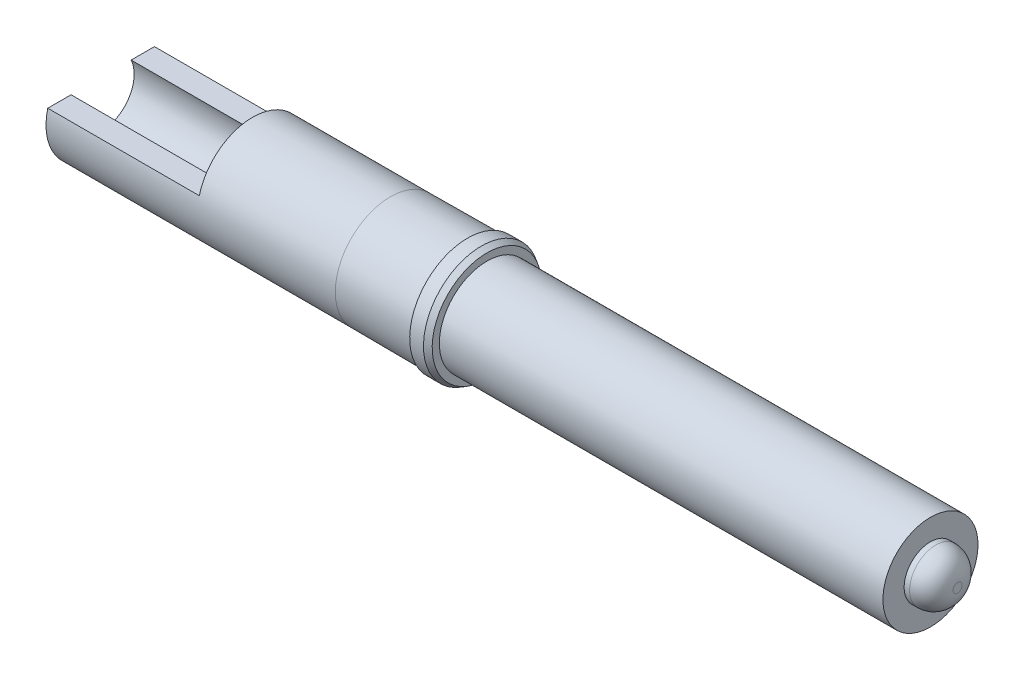
ISO-10303-21;
HEADER;
FILE_DESCRIPTION(('STEP AP214'),'2;1');
FILE_NAME('part.step','',(''),(''),'','','');
FILE_SCHEMA(('AUTOMOTIVE_DESIGN { 1 0 10303 214 1 1 1 1 }'));
ENDSEC;
DATA;
#1=APPLICATION_CONTEXT('core data for automotive mechanical design processes');
#2=APPLICATION_PROTOCOL_DEFINITION('international standard','automotive_design',2000,#1);
#3=PRODUCT_CONTEXT('',#1,'mechanical');
#4=PRODUCT('Part','Part','',(#3));
#5=PRODUCT_RELATED_PRODUCT_CATEGORY('part','',(#4));
#6=PRODUCT_DEFINITION_FORMATION('','',#4);
#7=PRODUCT_DEFINITION_CONTEXT('part definition',#1,'design');
#8=PRODUCT_DEFINITION('design','',#6,#7);
#9=PRODUCT_DEFINITION_SHAPE('','',#8);
#10=(LENGTH_UNIT() NAMED_UNIT(*) SI_UNIT(.MILLI.,.METRE.));
#11=(NAMED_UNIT(*) PLANE_ANGLE_UNIT() SI_UNIT($,.RADIAN.));
#12=(NAMED_UNIT(*) SI_UNIT($,.STERADIAN.) SOLID_ANGLE_UNIT());
#13=UNCERTAINTY_MEASURE_WITH_UNIT(LENGTH_MEASURE(1.E-05),#10,'distance_accuracy_value','');
#14=(GEOMETRIC_REPRESENTATION_CONTEXT(3) GLOBAL_UNCERTAINTY_ASSIGNED_CONTEXT((#13)) GLOBAL_UNIT_ASSIGNED_CONTEXT((#10,
#11,#12)) REPRESENTATION_CONTEXT('',''));
#15=CARTESIAN_POINT('',(0.,0.,0.));
#16=DIRECTION('',(0.,0.,1.));
#17=DIRECTION('',(1.,0.,0.));
#18=AXIS2_PLACEMENT_3D('',#15,#16,#17);
#19=CARTESIAN_POINT('',(1.397,0.127,-0.491868884968342));
#20=DIRECTION('',(0.,-1.,0.));
#21=DIRECTION('',(1.,0.,0.));
#22=AXIS2_PLACEMENT_3D('',#19,#20,#21);
#23=PLANE('',#22);
#24=DIRECTION('',(0.,0.,1.));
#25=VECTOR('',#24,1.);
#26=CARTESIAN_POINT('',(1.397,0.127,-0.491868884968342));
#27=LINE('',#26,#25);
#28=CARTESIAN_POINT('',(1.397,0.127,0.277081287711746));
#29=VERTEX_POINT('',#28);
#30=CARTESIAN_POINT('',(1.397,0.127,0.491868884968342));
#31=VERTEX_POINT('',#30);
#32=EDGE_CURVE('E111',#29,#31,#27,.T.);
#33=ORIENTED_EDGE('',*,*,#32,.F.);
#34=DIRECTION('',(-1.,0.,0.));
#35=VECTOR('',#34,1.);
#36=CARTESIAN_POINT('',(0.,0.127,0.277081287711746));
#37=LINE('',#36,#35);
#38=CARTESIAN_POINT('',(0.,0.127,0.277081287711746));
#39=VERTEX_POINT('',#38);
#40=EDGE_CURVE('E52',#29,#39,#37,.T.);
#41=ORIENTED_EDGE('',*,*,#40,.T.);
#42=DIRECTION('',(0.,0.,1.));
#43=VECTOR('',#42,1.);
#44=CARTESIAN_POINT('',(0.,0.127,-0.491868884968342));
#45=LINE('',#44,#43);
#46=CARTESIAN_POINT('',(0.,0.127,0.491868884968342));
#47=VERTEX_POINT('',#46);
#48=EDGE_CURVE('E103',#39,#47,#45,.T.);
#49=ORIENTED_EDGE('',*,*,#48,.T.);
#50=DIRECTION('',(-1.,0.,0.));
#51=VECTOR('',#50,1.);
#52=CARTESIAN_POINT('',(1.397,0.127,0.491868884968342));
#53=LINE('',#52,#51);
#54=EDGE_CURVE('E117',#31,#47,#53,.T.);
#55=ORIENTED_EDGE('',*,*,#54,.F.);
#56=EDGE_LOOP('',(#33,#41,#49,#55));
#57=FACE_BOUND('',#56,.T.);
#58=ADVANCED_FACE('F37',(#57),#23,.F.);
#59=CARTESIAN_POINT('',(3.5052,0.,0.));
#60=DIRECTION('',(-1.,0.,0.));
#61=DIRECTION('',(0.,-1.,0.));
#62=AXIS2_PLACEMENT_3D('',#59,#60,#61);
#63=CONICAL_SURFACE('',#62,0.5334,0.523598775598299);
#64=CARTESIAN_POINT('',(3.556,0.,0.));
#65=DIRECTION('',(-1.,0.,0.));
#66=DIRECTION('',(0.,-1.,0.));
#67=AXIS2_PLACEMENT_3D('',#64,#65,#66);
#68=CIRCLE('',#67,0.504070606325167);
#69=CARTESIAN_POINT('',(3.556,-0.504070606325167,0.));
#70=VERTEX_POINT('',#69);
#71=EDGE_CURVE('E194',#70,#70,#68,.T.);
#72=ORIENTED_EDGE('',*,*,#71,.T.);
#73=EDGE_LOOP('',(#72));
#74=FACE_BOUND('',#73,.T.);
#75=CARTESIAN_POINT('',(3.5052,0.,0.));
#76=DIRECTION('',(-1.,0.,0.));
#77=DIRECTION('',(0.,-1.,0.));
#78=AXIS2_PLACEMENT_3D('',#75,#76,#77);
#79=CIRCLE('',#78,0.5334);
#80=CARTESIAN_POINT('',(3.5052,-0.5334,0.));
#81=VERTEX_POINT('',#80);
#82=EDGE_CURVE('E199',#81,#81,#79,.T.);
#83=ORIENTED_EDGE('',*,*,#82,.F.);
#84=EDGE_LOOP('',(#83));
#85=FACE_BOUND('',#84,.T.);
#86=ADVANCED_FACE('F190',(#74,#85),#63,.T.);
#87=CARTESIAN_POINT('',(3.556,0.504070606325167,0.));
#88=DIRECTION('',(1.,0.,0.));
#89=DIRECTION('',(0.,1.,0.));
#90=AXIS2_PLACEMENT_3D('',#87,#88,#89);
#91=PLANE('',#90);
#92=CARTESIAN_POINT('',(3.556,0.,0.));
#93=DIRECTION('',(1.,0.,0.));
#94=DIRECTION('',(0.,0.,-1.));
#95=AXIS2_PLACEMENT_3D('',#92,#93,#94);
#96=CIRCLE('',#95,0.43815);
#97=CARTESIAN_POINT('',(3.556,0.,-0.43815));
#98=VERTEX_POINT('',#97);
#99=EDGE_CURVE('E104',#98,#98,#96,.T.);
#100=ORIENTED_EDGE('',*,*,#99,.F.);
#101=EDGE_LOOP('',(#100));
#102=FACE_BOUND('',#101,.T.);
#103=ORIENTED_EDGE('',*,*,#71,.F.);
#104=EDGE_LOOP('',(#103));
#105=FACE_BOUND('',#104,.T.);
#106=ADVANCED_FACE('F186',(#102,#105),#91,.T.);
#107=CARTESIAN_POINT('',(3.3782,0.,0.));
#108=DIRECTION('',(-1.,0.,0.));
#109=DIRECTION('',(0.,-1.,0.));
#110=AXIS2_PLACEMENT_3D('',#107,#108,#109);
#111=PLANE('',#110);
#112=CARTESIAN_POINT('',(3.3782,0.,0.));
#113=DIRECTION('',(-1.,0.,0.));
#114=DIRECTION('',(0.,0.,1.));
#115=AXIS2_PLACEMENT_3D('',#112,#113,#114);
#116=CIRCLE('',#115,0.51181);
#117=CARTESIAN_POINT('',(3.3782,0.,0.51181));
#118=VERTEX_POINT('',#117);
#119=EDGE_CURVE('E108',#118,#118,#116,.T.);
#120=ORIENTED_EDGE('',*,*,#119,.F.);
#121=EDGE_LOOP('',(#120));
#122=FACE_BOUND('',#121,.T.);
#123=CARTESIAN_POINT('',(3.3782,0.,0.));
#124=DIRECTION('',(-1.,0.,0.));
#125=DIRECTION('',(0.,-1.,0.));
#126=AXIS2_PLACEMENT_3D('',#123,#124,#125);
#127=CIRCLE('',#126,0.5334);
#128=CARTESIAN_POINT('',(3.3782,-0.5334,0.));
#129=VERTEX_POINT('',#128);
#130=EDGE_CURVE('E196',#129,#129,#127,.T.);
#131=ORIENTED_EDGE('',*,*,#130,.T.);
#132=EDGE_LOOP('',(#131));
#133=FACE_BOUND('',#132,.T.);
#134=ADVANCED_FACE('F189',(#122,#133),#111,.T.);
#135=CARTESIAN_POINT('',(3.556,0.,0.));
#136=DIRECTION('',(-1.,0.,0.));
#137=DIRECTION('',(0.,-1.,0.));
#138=AXIS2_PLACEMENT_3D('',#135,#136,#137);
#139=CYLINDRICAL_SURFACE('',#138,0.5334);
#140=ORIENTED_EDGE('',*,*,#82,.T.);
#141=EDGE_LOOP('',(#140));
#142=FACE_BOUND('',#141,.T.);
#143=ORIENTED_EDGE('',*,*,#130,.F.);
#144=EDGE_LOOP('',(#143));
#145=FACE_BOUND('',#144,.T.);
#146=ADVANCED_FACE('F151',(#142,#145),#139,.T.);
#147=CARTESIAN_POINT('',(2.667,0.,0.));
#148=DIRECTION('',(1.,0.,0.));
#149=DIRECTION('',(0.,0.,-1.));
#150=AXIS2_PLACEMENT_3D('',#147,#148,#149);
#151=CYLINDRICAL_SURFACE('',#150,0.51181);
#152=CARTESIAN_POINT('',(2.667,0.,0.));
#153=DIRECTION('',(-1.,0.,0.));
#154=DIRECTION('',(0.,0.,1.));
#155=AXIS2_PLACEMENT_3D('',#152,#153,#154);
#156=CIRCLE('',#155,0.508);
#157=CARTESIAN_POINT('',(2.667,0.,0.508));
#158=VERTEX_POINT('',#157);
#159=EDGE_CURVE('E124',#158,#158,#156,.T.);
#160=ORIENTED_EDGE('',*,*,#159,.F.);
#161=EDGE_LOOP('',(#160));
#162=FACE_BOUND('',#161,.T.);
#163=ORIENTED_EDGE('',*,*,#119,.T.);
#164=EDGE_LOOP('',(#163));
#165=FACE_BOUND('',#164,.T.);
#166=ADVANCED_FACE('F145',(#162,#165),#151,.T.);
#167=CARTESIAN_POINT('',(0.,0.,0.));
#168=DIRECTION('',(1.,0.,0.));
#169=DIRECTION('',(0.,0.,-1.));
#170=AXIS2_PLACEMENT_3D('',#167,#168,#169);
#171=CYLINDRICAL_SURFACE('',#170,0.508);
#172=CARTESIAN_POINT('',(0.,0.,0.));
#173=DIRECTION('',(-1.,0.,0.));
#174=DIRECTION('',(0.,0.,1.));
#175=AXIS2_PLACEMENT_3D('',#172,#173,#174);
#176=CIRCLE('',#175,0.508);
#177=CARTESIAN_POINT('',(0.,0.127,-0.491868884968342));
#178=VERTEX_POINT('',#177);
#179=EDGE_CURVE('E120',#178,#47,#176,.T.);
#180=ORIENTED_EDGE('',*,*,#179,.F.);
#181=DIRECTION('',(-1.,0.,0.));
#182=VECTOR('',#181,1.);
#183=CARTESIAN_POINT('',(1.397,0.127,-0.491868884968342));
#184=LINE('',#183,#182);
#185=CARTESIAN_POINT('',(1.397,0.127,-0.491868884968342));
#186=VERTEX_POINT('',#185);
#187=EDGE_CURVE('E60',#186,#178,#184,.T.);
#188=ORIENTED_EDGE('',*,*,#187,.F.);
#189=CARTESIAN_POINT('',(1.397,0.,0.));
#190=DIRECTION('',(-1.,0.,0.));
#191=DIRECTION('',(0.,0.,1.));
#192=AXIS2_PLACEMENT_3D('',#189,#190,#191);
#193=CIRCLE('',#192,0.508);
#194=EDGE_CURVE('E109',#31,#186,#193,.T.);
#195=ORIENTED_EDGE('',*,*,#194,.F.);
#196=ORIENTED_EDGE('',*,*,#54,.T.);
#197=EDGE_LOOP('',(#180,#188,#195,#196));
#198=FACE_BOUND('',#197,.T.);
#199=ORIENTED_EDGE('',*,*,#159,.T.);
#200=EDGE_LOOP('',(#199));
#201=FACE_BOUND('',#200,.T.);
#202=ADVANCED_FACE('F134',(#198,#201),#171,.T.);
#203=CARTESIAN_POINT('',(0.,0.,0.));
#204=DIRECTION('',(-1.,0.,0.));
#205=DIRECTION('',(0.,0.,1.));
#206=AXIS2_PLACEMENT_3D('',#203,#204,#205);
#207=PLANE('',#206);
#208=CARTESIAN_POINT('',(0.,0.,0.));
#209=DIRECTION('',(-1.,0.,0.));
#210=DIRECTION('',(0.,0.,1.));
#211=AXIS2_PLACEMENT_3D('',#208,#209,#210);
#212=CIRCLE('',#211,0.304799999999999);
#213=CARTESIAN_POINT('',(0.,0.127,-0.277081287711746));
#214=VERTEX_POINT('',#213);
#215=EDGE_CURVE('E92',#214,#39,#212,.T.);
#216=ORIENTED_EDGE('',*,*,#215,.F.);
#217=EDGE_CURVE('E112',#178,#214,#45,.T.);
#218=ORIENTED_EDGE('',*,*,#217,.F.);
#219=ORIENTED_EDGE('',*,*,#179,.T.);
#220=ORIENTED_EDGE('',*,*,#48,.F.);
#221=EDGE_LOOP('',(#216,#218,#219,#220));
#222=FACE_BOUND('',#221,.T.);
#223=ADVANCED_FACE('F144',(#222),#207,.T.);
#224=ORIENTED_EDGE('',*,*,#217,.T.);
#225=DIRECTION('',(-1.,0.,0.));
#226=VECTOR('',#225,1.);
#227=CARTESIAN_POINT('',(0.,0.127,-0.277081287711746));
#228=LINE('',#227,#226);
#229=CARTESIAN_POINT('',(1.397,0.127,-0.277081287711746));
#230=VERTEX_POINT('',#229);
#231=EDGE_CURVE('E91',#214,#230,#228,.F.);
#232=ORIENTED_EDGE('',*,*,#231,.T.);
#233=EDGE_CURVE('E113',#186,#230,#27,.T.);
#234=ORIENTED_EDGE('',*,*,#233,.F.);
#235=ORIENTED_EDGE('',*,*,#187,.T.);
#236=EDGE_LOOP('',(#224,#232,#234,#235));
#237=FACE_BOUND('',#236,.T.);
#238=ADVANCED_FACE('F211',(#237),#23,.F.);
#239=CARTESIAN_POINT('',(1.397,0.,0.));
#240=DIRECTION('',(-1.,0.,0.));
#241=DIRECTION('',(0.,0.,1.));
#242=AXIS2_PLACEMENT_3D('',#239,#240,#241);
#243=PLANE('',#242);
#244=CARTESIAN_POINT('',(1.397,0.,0.));
#245=DIRECTION('',(-1.,0.,0.));
#246=DIRECTION('',(0.,0.,1.));
#247=AXIS2_PLACEMENT_3D('',#244,#245,#246);
#248=CIRCLE('',#247,0.304799999999999);
#249=EDGE_CURVE('E107',#29,#230,#248,.T.);
#250=ORIENTED_EDGE('',*,*,#249,.F.);
#251=ORIENTED_EDGE('',*,*,#32,.T.);
#252=ORIENTED_EDGE('',*,*,#194,.T.);
#253=ORIENTED_EDGE('',*,*,#233,.T.);
#254=EDGE_LOOP('',(#250,#251,#252,#253));
#255=FACE_BOUND('',#254,.T.);
#256=ADVANCED_FACE('F182',(#255),#243,.T.);
#257=CARTESIAN_POINT('',(7.6454,0.,0.));
#258=DIRECTION('',(-1.,0.,0.));
#259=DIRECTION('',(0.,0.,1.));
#260=AXIS2_PLACEMENT_3D('',#257,#258,#259);
#261=CYLINDRICAL_SURFACE('',#260,0.43815);
#262=CARTESIAN_POINT('',(7.6454,0.,0.));
#263=DIRECTION('',(1.,0.,0.));
#264=DIRECTION('',(0.,0.,-1.));
#265=AXIS2_PLACEMENT_3D('',#262,#263,#264);
#266=CIRCLE('',#265,0.43815);
#267=CARTESIAN_POINT('',(7.6454,0.,-0.43815));
#268=VERTEX_POINT('',#267);
#269=EDGE_CURVE('E100',#268,#268,#266,.T.);
#270=ORIENTED_EDGE('',*,*,#269,.F.);
#271=EDGE_LOOP('',(#270));
#272=FACE_BOUND('',#271,.T.);
#273=ORIENTED_EDGE('',*,*,#99,.T.);
#274=EDGE_LOOP('',(#273));
#275=FACE_BOUND('',#274,.T.);
#276=ADVANCED_FACE('F176',(#272,#275),#261,.T.);
#277=CARTESIAN_POINT('',(7.6454,0.,0.));
#278=DIRECTION('',(1.,0.,0.));
#279=DIRECTION('',(0.,0.,-1.));
#280=AXIS2_PLACEMENT_3D('',#277,#278,#279);
#281=PLANE('',#280);
#282=CARTESIAN_POINT('',(7.6454,0.,0.));
#283=DIRECTION('',(1.,0.,0.));
#284=DIRECTION('',(0.,0.,-1.));
#285=AXIS2_PLACEMENT_3D('',#282,#283,#284);
#286=CIRCLE('',#285,0.24257);
#287=CARTESIAN_POINT('',(7.6454,0.,-0.24257));
#288=VERTEX_POINT('',#287);
#289=EDGE_CURVE('E165',#288,#288,#286,.T.);
#290=ORIENTED_EDGE('',*,*,#289,.F.);
#291=EDGE_LOOP('',(#290));
#292=FACE_BOUND('',#291,.T.);
#293=ORIENTED_EDGE('',*,*,#269,.T.);
#294=EDGE_LOOP('',(#293));
#295=FACE_BOUND('',#294,.T.);
#296=ADVANCED_FACE('F173',(#292,#295),#281,.T.);
#297=CARTESIAN_POINT('',(0.,0.,0.));
#298=DIRECTION('',(-1.,0.,0.));
#299=DIRECTION('',(0.,0.,1.));
#300=AXIS2_PLACEMENT_3D('',#297,#298,#299);
#301=CYLINDRICAL_SURFACE('',#300,0.304799999999999);
#302=CARTESIAN_POINT('',(2.54,0.,0.));
#303=DIRECTION('',(-1.,0.,0.));
#304=DIRECTION('',(0.,0.,1.));
#305=AXIS2_PLACEMENT_3D('',#302,#303,#304);
#306=CIRCLE('',#305,0.304799999999999);
#307=CARTESIAN_POINT('',(2.54,0.,0.304799999999999));
#308=VERTEX_POINT('',#307);
#309=EDGE_CURVE('E89',#308,#308,#306,.T.);
#310=ORIENTED_EDGE('',*,*,#309,.F.);
#311=EDGE_LOOP('',(#310));
#312=FACE_BOUND('',#311,.T.);
#313=ORIENTED_EDGE('',*,*,#249,.T.);
#314=ORIENTED_EDGE('',*,*,#231,.F.);
#315=ORIENTED_EDGE('',*,*,#215,.T.);
#316=ORIENTED_EDGE('',*,*,#40,.F.);
#317=EDGE_LOOP('',(#313,#314,#315,#316));
#318=FACE_BOUND('',#317,.T.);
#319=ADVANCED_FACE('F85',(#312,#318),#301,.F.);
#320=CARTESIAN_POINT('',(2.54,0.,0.));
#321=DIRECTION('',(-1.,0.,0.));
#322=DIRECTION('',(0.,0.,1.));
#323=AXIS2_PLACEMENT_3D('',#320,#321,#322);
#324=CONICAL_SURFACE('',#323,0.304799999999999,1.02974425867666);
#325=CARTESIAN_POINT('',(2.7231423166796,0.,0.));
#326=VERTEX_POINT('',#325);
#327=VERTEX_LOOP('',#326);
#328=FACE_BOUND('',#327,.T.);
#329=ORIENTED_EDGE('',*,*,#309,.T.);
#330=EDGE_LOOP('',(#329));
#331=FACE_BOUND('',#330,.T.);
#332=ADVANCED_FACE('F81',(#328,#331),#324,.F.);
#333=CARTESIAN_POINT('',(7.8954,0.,0.));
#334=DIRECTION('',(-1.,0.,0.));
#335=DIRECTION('',(0.,0.,1.));
#336=AXIS2_PLACEMENT_3D('',#333,#334,#335);
#337=CYLINDRICAL_SURFACE('',#336,0.24257);
#338=CARTESIAN_POINT('',(7.6954,0.,0.));
#339=DIRECTION('',(1.,0.,0.));
#340=DIRECTION('',(0.,0.,-1.));
#341=AXIS2_PLACEMENT_3D('',#338,#339,#340);
#342=CIRCLE('',#341,0.24257);
#343=CARTESIAN_POINT('',(7.6954,0.,-0.24257));
#344=VERTEX_POINT('',#343);
#345=EDGE_CURVE('E11',#344,#344,#342,.F.);
#346=ORIENTED_EDGE('',*,*,#345,.T.);
#347=EDGE_LOOP('',(#346));
#348=FACE_BOUND('',#347,.T.);
#349=ORIENTED_EDGE('',*,*,#289,.T.);
#350=EDGE_LOOP('',(#349));
#351=FACE_BOUND('',#350,.T.);
#352=ADVANCED_FACE('F84',(#348,#351),#337,.T.);
#353=CARTESIAN_POINT('',(7.8954,0.,0.));
#354=DIRECTION('',(1.,0.,0.));
#355=DIRECTION('',(0.,0.,-1.));
#356=AXIS2_PLACEMENT_3D('',#353,#354,#355);
#357=PLANE('',#356);
#358=CARTESIAN_POINT('',(7.8954,0.,0.));
#359=DIRECTION('',(1.,0.,0.));
#360=DIRECTION('',(0.,0.,-1.));
#361=AXIS2_PLACEMENT_3D('',#358,#359,#360);
#362=CIRCLE('',#361,0.04257);
#363=CARTESIAN_POINT('',(7.8954,0.,-0.0425700000000003));
#364=VERTEX_POINT('',#363);
#365=EDGE_CURVE('E45',#364,#364,#362,.T.);
#366=ORIENTED_EDGE('',*,*,#365,.T.);
#367=EDGE_LOOP('',(#366));
#368=FACE_BOUND('',#367,.T.);
#369=ADVANCED_FACE('F275',(#368),#357,.T.);
#370=CARTESIAN_POINT('',(7.6954,0.,0.));
#371=DIRECTION('',(1.,0.,0.));
#372=DIRECTION('',(0.,0.,-1.));
#373=AXIS2_PLACEMENT_3D('',#370,#371,#372);
#374=DEGENERATE_TOROIDAL_SURFACE('',#373,0.04257,0.2,.T.);
#375=ORIENTED_EDGE('',*,*,#345,.F.);
#376=EDGE_LOOP('',(#375));
#377=FACE_BOUND('',#376,.T.);
#378=ORIENTED_EDGE('',*,*,#365,.F.);
#379=EDGE_LOOP('',(#378));
#380=FACE_BOUND('',#379,.T.);
#381=ADVANCED_FACE('F39',(#377,#380),#374,.T.);
#382=CLOSED_SHELL('',(#58,#86,#106,#134,#146,#166,#202,#223,#238,#256,#276,#296,#319,#332,#352,
#369,#381));
#383=MANIFOLD_SOLID_BREP('B2',#382);
#384=ADVANCED_BREP_SHAPE_REPRESENTATION('',(#18,#383),#14);
#385=SHAPE_DEFINITION_REPRESENTATION(#9,#384);
ENDSEC;
END-ISO-10303-21;
